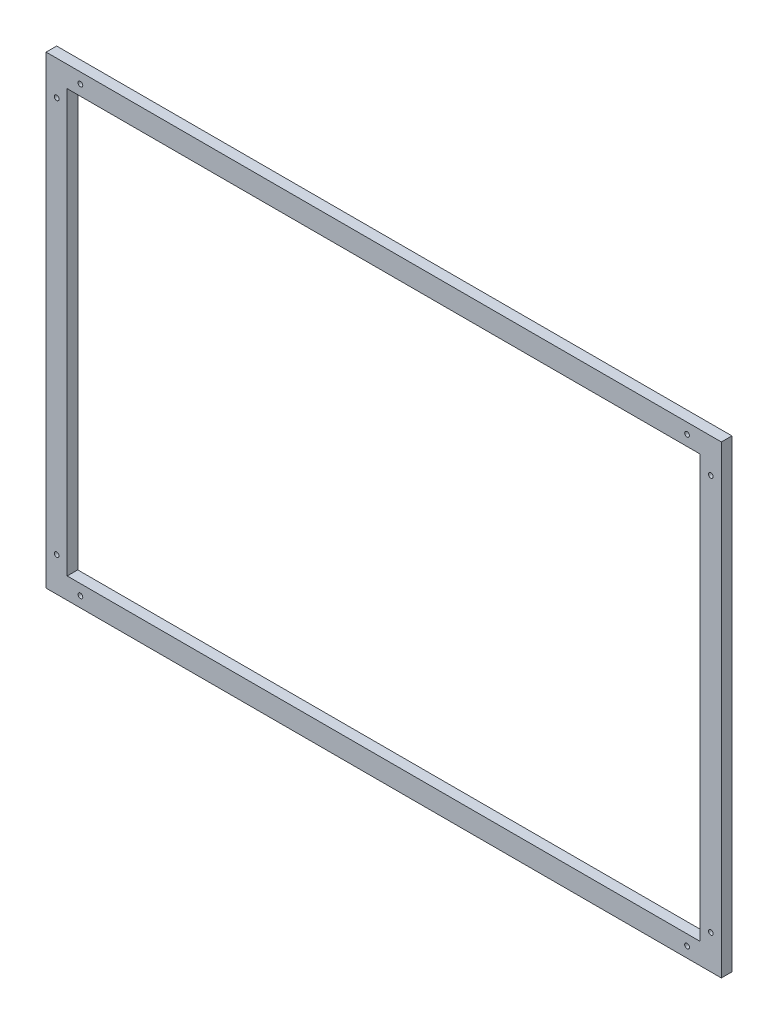
ISO-10303-21;
HEADER;
FILE_DESCRIPTION(('STEP AP214'),'2;1');
FILE_NAME('part.step','',(''),(''),'','','');
FILE_SCHEMA(('AUTOMOTIVE_DESIGN { 1 0 10303 214 1 1 1 1 }'));
ENDSEC;
DATA;
#1=APPLICATION_CONTEXT('core data for automotive mechanical design processes');
#2=APPLICATION_PROTOCOL_DEFINITION('international standard','automotive_design',2000,#1);
#3=PRODUCT_CONTEXT('',#1,'mechanical');
#4=PRODUCT('Part','Part','',(#3));
#5=PRODUCT_RELATED_PRODUCT_CATEGORY('part','',(#4));
#6=PRODUCT_DEFINITION_FORMATION('','',#4);
#7=PRODUCT_DEFINITION_CONTEXT('part definition',#1,'design');
#8=PRODUCT_DEFINITION('design','',#6,#7);
#9=PRODUCT_DEFINITION_SHAPE('','',#8);
#10=(LENGTH_UNIT() NAMED_UNIT(*) SI_UNIT(.MILLI.,.METRE.));
#11=(NAMED_UNIT(*) PLANE_ANGLE_UNIT() SI_UNIT($,.RADIAN.));
#12=(NAMED_UNIT(*) SI_UNIT($,.STERADIAN.) SOLID_ANGLE_UNIT());
#13=UNCERTAINTY_MEASURE_WITH_UNIT(LENGTH_MEASURE(1.E-05),#10,'distance_accuracy_value','');
#14=(GEOMETRIC_REPRESENTATION_CONTEXT(3) GLOBAL_UNCERTAINTY_ASSIGNED_CONTEXT((#13)) GLOBAL_UNIT_ASSIGNED_CONTEXT((#10,
#11,#12)) REPRESENTATION_CONTEXT('',''));
#15=CARTESIAN_POINT('',(0.,0.,0.));
#16=DIRECTION('',(0.,0.,1.));
#17=DIRECTION('',(1.,0.,0.));
#18=AXIS2_PLACEMENT_3D('',#15,#16,#17);
#19=CARTESIAN_POINT('',(0.,0.,10.));
#20=DIRECTION('',(0.,0.,1.));
#21=DIRECTION('',(1.,0.,0.));
#22=AXIS2_PLACEMENT_3D('',#19,#20,#21);
#23=PLANE('',#22);
#24=CARTESIAN_POINT('',(-10.,32.5,10.));
#25=DIRECTION('',(0.,0.,1.));
#26=DIRECTION('',(1.,0.,0.));
#27=AXIS2_PLACEMENT_3D('',#24,#25,#26);
#28=CIRCLE('',#27,2.25);
#29=CARTESIAN_POINT('',(-7.75,32.5,10.));
#30=VERTEX_POINT('',#29);
#31=EDGE_CURVE('E253',#30,#30,#28,.T.);
#32=ORIENTED_EDGE('',*,*,#31,.F.);
#33=EDGE_LOOP('',(#32));
#34=FACE_BOUND('',#33,.T.);
#35=CARTESIAN_POINT('',(-32.5,9.99999999999992,10.));
#36=DIRECTION('',(0.,0.,1.));
#37=DIRECTION('',(1.,0.,0.));
#38=AXIS2_PLACEMENT_3D('',#35,#36,#37);
#39=CIRCLE('',#38,2.25);
#40=CARTESIAN_POINT('',(-30.25,9.99999999999992,10.));
#41=VERTEX_POINT('',#40);
#42=EDGE_CURVE('E255',#41,#41,#39,.T.);
#43=ORIENTED_EDGE('',*,*,#42,.F.);
#44=EDGE_LOOP('',(#43));
#45=FACE_BOUND('',#44,.T.);
#46=CARTESIAN_POINT('',(-607.5,9.99999999999995,10.));
#47=DIRECTION('',(0.,0.,1.));
#48=DIRECTION('',(1.,0.,0.));
#49=AXIS2_PLACEMENT_3D('',#46,#47,#48);
#50=CIRCLE('',#49,2.25000000000001);
#51=CARTESIAN_POINT('',(-605.25,9.99999999999995,10.));
#52=VERTEX_POINT('',#51);
#53=EDGE_CURVE('E261',#52,#52,#50,.T.);
#54=ORIENTED_EDGE('',*,*,#53,.F.);
#55=EDGE_LOOP('',(#54));
#56=FACE_BOUND('',#55,.T.);
#57=CARTESIAN_POINT('',(-630.,32.4999999999999,10.));
#58=DIRECTION('',(0.,0.,1.));
#59=DIRECTION('',(1.,0.,0.));
#60=AXIS2_PLACEMENT_3D('',#57,#58,#59);
#61=CIRCLE('',#60,2.25000000000001);
#62=CARTESIAN_POINT('',(-627.75,32.4999999999999,10.));
#63=VERTEX_POINT('',#62);
#64=EDGE_CURVE('E267',#63,#63,#61,.T.);
#65=ORIENTED_EDGE('',*,*,#64,.F.);
#66=EDGE_LOOP('',(#65));
#67=FACE_BOUND('',#66,.T.);
#68=CARTESIAN_POINT('',(-630.,407.5,10.));
#69=DIRECTION('',(0.,0.,1.));
#70=DIRECTION('',(1.,0.,0.));
#71=AXIS2_PLACEMENT_3D('',#68,#69,#70);
#72=CIRCLE('',#71,2.25000000000001);
#73=CARTESIAN_POINT('',(-627.75,407.5,10.));
#74=VERTEX_POINT('',#73);
#75=EDGE_CURVE('E273',#74,#74,#72,.T.);
#76=ORIENTED_EDGE('',*,*,#75,.F.);
#77=EDGE_LOOP('',(#76));
#78=FACE_BOUND('',#77,.T.);
#79=CARTESIAN_POINT('',(-607.5,430.,10.));
#80=DIRECTION('',(0.,0.,1.));
#81=DIRECTION('',(1.,0.,0.));
#82=AXIS2_PLACEMENT_3D('',#79,#80,#81);
#83=CIRCLE('',#82,2.25000000000001);
#84=CARTESIAN_POINT('',(-605.25,430.,10.));
#85=VERTEX_POINT('',#84);
#86=EDGE_CURVE('E279',#85,#85,#83,.T.);
#87=ORIENTED_EDGE('',*,*,#86,.F.);
#88=EDGE_LOOP('',(#87));
#89=FACE_BOUND('',#88,.T.);
#90=CARTESIAN_POINT('',(-10.,407.5,10.));
#91=DIRECTION('',(0.,0.,1.));
#92=DIRECTION('',(1.,0.,0.));
#93=AXIS2_PLACEMENT_3D('',#90,#91,#92);
#94=CIRCLE('',#93,2.25);
#95=CARTESIAN_POINT('',(-7.75,407.5,10.));
#96=VERTEX_POINT('',#95);
#97=EDGE_CURVE('E285',#96,#96,#94,.T.);
#98=ORIENTED_EDGE('',*,*,#97,.F.);
#99=EDGE_LOOP('',(#98));
#100=FACE_BOUND('',#99,.T.);
#101=CARTESIAN_POINT('',(-32.5,430.,10.));
#102=DIRECTION('',(0.,0.,1.));
#103=DIRECTION('',(1.,0.,0.));
#104=AXIS2_PLACEMENT_3D('',#101,#102,#103);
#105=CIRCLE('',#104,2.25);
#106=CARTESIAN_POINT('',(-30.25,430.,10.));
#107=VERTEX_POINT('',#106);
#108=EDGE_CURVE('E291',#107,#107,#105,.T.);
#109=ORIENTED_EDGE('',*,*,#108,.F.);
#110=EDGE_LOOP('',(#109));
#111=FACE_BOUND('',#110,.T.);
#112=DIRECTION('',(0.,1.,0.));
#113=VECTOR('',#112,1.);
#114=CARTESIAN_POINT('',(0.,0.,10.));
#115=LINE('',#114,#113);
#116=CARTESIAN_POINT('',(0.,0.,10.));
#117=VERTEX_POINT('',#116);
#118=CARTESIAN_POINT('',(0.,440.,10.));
#119=VERTEX_POINT('',#118);
#120=EDGE_CURVE('E135',#117,#119,#115,.T.);
#121=ORIENTED_EDGE('',*,*,#120,.T.);
#122=DIRECTION('',(-1.,0.,0.));
#123=VECTOR('',#122,1.);
#124=CARTESIAN_POINT('',(0.,440.,10.));
#125=LINE('',#124,#123);
#126=CARTESIAN_POINT('',(-640.,440.,10.));
#127=VERTEX_POINT('',#126);
#128=EDGE_CURVE('E138',#119,#127,#125,.T.);
#129=ORIENTED_EDGE('',*,*,#128,.T.);
#130=DIRECTION('',(0.,-1.,0.));
#131=VECTOR('',#130,1.);
#132=CARTESIAN_POINT('',(-640.,0.,10.));
#133=LINE('',#132,#131);
#134=CARTESIAN_POINT('',(-640.,0.,10.));
#135=VERTEX_POINT('',#134);
#136=EDGE_CURVE('E141',#127,#135,#133,.T.);
#137=ORIENTED_EDGE('',*,*,#136,.T.);
#138=DIRECTION('',(1.,0.,0.));
#139=VECTOR('',#138,1.);
#140=CARTESIAN_POINT('',(0.,0.,10.));
#141=LINE('',#140,#139);
#142=EDGE_CURVE('E143',#135,#117,#141,.T.);
#143=ORIENTED_EDGE('',*,*,#142,.T.);
#144=EDGE_LOOP('',(#121,#129,#137,#143));
#145=FACE_BOUND('',#144,.T.);
#146=DIRECTION('',(1.,0.,0.));
#147=VECTOR('',#146,1.);
#148=CARTESIAN_POINT('',(-620.,19.9999999999999,10.));
#149=LINE('',#148,#147);
#150=CARTESIAN_POINT('',(-620.,19.9999999999999,10.));
#151=VERTEX_POINT('',#150);
#152=CARTESIAN_POINT('',(-20.,19.9999999999999,10.));
#153=VERTEX_POINT('',#152);
#154=EDGE_CURVE('E105',#151,#153,#149,.T.);
#155=ORIENTED_EDGE('',*,*,#154,.F.);
#156=DIRECTION('',(0.,-1.,0.));
#157=VECTOR('',#156,1.);
#158=CARTESIAN_POINT('',(-620.,420.,10.));
#159=LINE('',#158,#157);
#160=CARTESIAN_POINT('',(-620.,420.,10.));
#161=VERTEX_POINT('',#160);
#162=EDGE_CURVE('E97',#161,#151,#159,.T.);
#163=ORIENTED_EDGE('',*,*,#162,.F.);
#164=DIRECTION('',(-1.,0.,0.));
#165=VECTOR('',#164,1.);
#166=CARTESIAN_POINT('',(-620.,420.,10.));
#167=LINE('',#166,#165);
#168=CARTESIAN_POINT('',(-20.,420.,10.));
#169=VERTEX_POINT('',#168);
#170=EDGE_CURVE('E119',#169,#161,#167,.T.);
#171=ORIENTED_EDGE('',*,*,#170,.F.);
#172=DIRECTION('',(0.,1.,0.));
#173=VECTOR('',#172,1.);
#174=CARTESIAN_POINT('',(-20.,420.,10.));
#175=LINE('',#174,#173);
#176=EDGE_CURVE('E117',#153,#169,#175,.T.);
#177=ORIENTED_EDGE('',*,*,#176,.F.);
#178=EDGE_LOOP('',(#155,#163,#171,#177));
#179=FACE_BOUND('',#178,.T.);
#180=ADVANCED_FACE('F32',(#34,#45,#56,#67,#78,#89,#100,#111,#145,#179),#23,.T.);
#181=CARTESIAN_POINT('',(0.,0.,0.));
#182=DIRECTION('',(0.,0.,1.));
#183=DIRECTION('',(1.,0.,0.));
#184=AXIS2_PLACEMENT_3D('',#181,#182,#183);
#185=PLANE('',#184);
#186=CARTESIAN_POINT('',(-10.,32.5,0.));
#187=DIRECTION('',(0.,0.,1.));
#188=DIRECTION('',(1.,0.,0.));
#189=AXIS2_PLACEMENT_3D('',#186,#187,#188);
#190=CIRCLE('',#189,2.25);
#191=CARTESIAN_POINT('',(-7.75,32.5,0.));
#192=VERTEX_POINT('',#191);
#193=EDGE_CURVE('E251',#192,#192,#190,.T.);
#194=ORIENTED_EDGE('',*,*,#193,.T.);
#195=EDGE_LOOP('',(#194));
#196=FACE_BOUND('',#195,.T.);
#197=CARTESIAN_POINT('',(-32.5,9.99999999999992,0.));
#198=DIRECTION('',(0.,0.,1.));
#199=DIRECTION('',(1.,0.,0.));
#200=AXIS2_PLACEMENT_3D('',#197,#198,#199);
#201=CIRCLE('',#200,2.25);
#202=CARTESIAN_POINT('',(-30.25,9.99999999999992,0.));
#203=VERTEX_POINT('',#202);
#204=EDGE_CURVE('E258',#203,#203,#201,.T.);
#205=ORIENTED_EDGE('',*,*,#204,.T.);
#206=EDGE_LOOP('',(#205));
#207=FACE_BOUND('',#206,.T.);
#208=CARTESIAN_POINT('',(-607.5,9.99999999999995,0.));
#209=DIRECTION('',(0.,0.,1.));
#210=DIRECTION('',(1.,0.,0.));
#211=AXIS2_PLACEMENT_3D('',#208,#209,#210);
#212=CIRCLE('',#211,2.25000000000001);
#213=CARTESIAN_POINT('',(-605.25,9.99999999999995,0.));
#214=VERTEX_POINT('',#213);
#215=EDGE_CURVE('E264',#214,#214,#212,.T.);
#216=ORIENTED_EDGE('',*,*,#215,.T.);
#217=EDGE_LOOP('',(#216));
#218=FACE_BOUND('',#217,.T.);
#219=CARTESIAN_POINT('',(-630.,32.4999999999999,0.));
#220=DIRECTION('',(0.,0.,1.));
#221=DIRECTION('',(1.,0.,0.));
#222=AXIS2_PLACEMENT_3D('',#219,#220,#221);
#223=CIRCLE('',#222,2.25000000000001);
#224=CARTESIAN_POINT('',(-627.75,32.4999999999999,0.));
#225=VERTEX_POINT('',#224);
#226=EDGE_CURVE('E270',#225,#225,#223,.T.);
#227=ORIENTED_EDGE('',*,*,#226,.T.);
#228=EDGE_LOOP('',(#227));
#229=FACE_BOUND('',#228,.T.);
#230=CARTESIAN_POINT('',(-630.,407.5,0.));
#231=DIRECTION('',(0.,0.,1.));
#232=DIRECTION('',(1.,0.,0.));
#233=AXIS2_PLACEMENT_3D('',#230,#231,#232);
#234=CIRCLE('',#233,2.25000000000001);
#235=CARTESIAN_POINT('',(-627.75,407.5,0.));
#236=VERTEX_POINT('',#235);
#237=EDGE_CURVE('E276',#236,#236,#234,.T.);
#238=ORIENTED_EDGE('',*,*,#237,.T.);
#239=EDGE_LOOP('',(#238));
#240=FACE_BOUND('',#239,.T.);
#241=CARTESIAN_POINT('',(-607.5,430.,0.));
#242=DIRECTION('',(0.,0.,1.));
#243=DIRECTION('',(1.,0.,0.));
#244=AXIS2_PLACEMENT_3D('',#241,#242,#243);
#245=CIRCLE('',#244,2.25000000000001);
#246=CARTESIAN_POINT('',(-605.25,430.,0.));
#247=VERTEX_POINT('',#246);
#248=EDGE_CURVE('E282',#247,#247,#245,.T.);
#249=ORIENTED_EDGE('',*,*,#248,.T.);
#250=EDGE_LOOP('',(#249));
#251=FACE_BOUND('',#250,.T.);
#252=CARTESIAN_POINT('',(-10.,407.5,0.));
#253=DIRECTION('',(0.,0.,1.));
#254=DIRECTION('',(1.,0.,0.));
#255=AXIS2_PLACEMENT_3D('',#252,#253,#254);
#256=CIRCLE('',#255,2.25);
#257=CARTESIAN_POINT('',(-7.75,407.5,0.));
#258=VERTEX_POINT('',#257);
#259=EDGE_CURVE('E288',#258,#258,#256,.T.);
#260=ORIENTED_EDGE('',*,*,#259,.T.);
#261=EDGE_LOOP('',(#260));
#262=FACE_BOUND('',#261,.T.);
#263=CARTESIAN_POINT('',(-32.5,430.,0.));
#264=DIRECTION('',(0.,0.,1.));
#265=DIRECTION('',(1.,0.,0.));
#266=AXIS2_PLACEMENT_3D('',#263,#264,#265);
#267=CIRCLE('',#266,2.25);
#268=CARTESIAN_POINT('',(-30.25,430.,0.));
#269=VERTEX_POINT('',#268);
#270=EDGE_CURVE('E125',#269,#269,#267,.T.);
#271=ORIENTED_EDGE('',*,*,#270,.T.);
#272=EDGE_LOOP('',(#271));
#273=FACE_BOUND('',#272,.T.);
#274=DIRECTION('',(0.,1.,0.));
#275=VECTOR('',#274,1.);
#276=CARTESIAN_POINT('',(0.,0.,0.));
#277=LINE('',#276,#275);
#278=CARTESIAN_POINT('',(0.,0.,0.));
#279=VERTEX_POINT('',#278);
#280=CARTESIAN_POINT('',(0.,440.,0.));
#281=VERTEX_POINT('',#280);
#282=EDGE_CURVE('E113',#279,#281,#277,.T.);
#283=ORIENTED_EDGE('',*,*,#282,.F.);
#284=DIRECTION('',(1.,0.,0.));
#285=VECTOR('',#284,1.);
#286=CARTESIAN_POINT('',(0.,0.,0.));
#287=LINE('',#286,#285);
#288=CARTESIAN_POINT('',(-640.,0.,0.));
#289=VERTEX_POINT('',#288);
#290=EDGE_CURVE('E139',#289,#279,#287,.T.);
#291=ORIENTED_EDGE('',*,*,#290,.F.);
#292=DIRECTION('',(0.,-1.,0.));
#293=VECTOR('',#292,1.);
#294=CARTESIAN_POINT('',(-640.,0.,0.));
#295=LINE('',#294,#293);
#296=CARTESIAN_POINT('',(-640.,440.,0.));
#297=VERTEX_POINT('',#296);
#298=EDGE_CURVE('E150',#297,#289,#295,.T.);
#299=ORIENTED_EDGE('',*,*,#298,.F.);
#300=DIRECTION('',(-1.,0.,0.));
#301=VECTOR('',#300,1.);
#302=CARTESIAN_POINT('',(0.,440.,0.));
#303=LINE('',#302,#301);
#304=EDGE_CURVE('E148',#281,#297,#303,.T.);
#305=ORIENTED_EDGE('',*,*,#304,.F.);
#306=EDGE_LOOP('',(#283,#291,#299,#305));
#307=FACE_BOUND('',#306,.T.);
#308=DIRECTION('',(0.,-1.,0.));
#309=VECTOR('',#308,1.);
#310=CARTESIAN_POINT('',(-620.,420.,0.));
#311=LINE('',#310,#309);
#312=CARTESIAN_POINT('',(-620.,420.,0.));
#313=VERTEX_POINT('',#312);
#314=CARTESIAN_POINT('',(-620.,19.9999999999999,0.));
#315=VERTEX_POINT('',#314);
#316=EDGE_CURVE('E55',#313,#315,#311,.T.);
#317=ORIENTED_EDGE('',*,*,#316,.T.);
#318=DIRECTION('',(1.,0.,0.));
#319=VECTOR('',#318,1.);
#320=CARTESIAN_POINT('',(-620.,19.9999999999999,0.));
#321=LINE('',#320,#319);
#322=CARTESIAN_POINT('',(-20.,19.9999999999999,0.));
#323=VERTEX_POINT('',#322);
#324=EDGE_CURVE('E112',#315,#323,#321,.T.);
#325=ORIENTED_EDGE('',*,*,#324,.T.);
#326=DIRECTION('',(0.,1.,0.));
#327=VECTOR('',#326,1.);
#328=CARTESIAN_POINT('',(-20.,420.,0.));
#329=LINE('',#328,#327);
#330=CARTESIAN_POINT('',(-20.,420.,0.));
#331=VERTEX_POINT('',#330);
#332=EDGE_CURVE('E127',#323,#331,#329,.T.);
#333=ORIENTED_EDGE('',*,*,#332,.T.);
#334=DIRECTION('',(-1.,0.,0.));
#335=VECTOR('',#334,1.);
#336=CARTESIAN_POINT('',(-620.,420.,0.));
#337=LINE('',#336,#335);
#338=EDGE_CURVE('E106',#331,#313,#337,.T.);
#339=ORIENTED_EDGE('',*,*,#338,.T.);
#340=EDGE_LOOP('',(#317,#325,#333,#339));
#341=FACE_BOUND('',#340,.T.);
#342=ADVANCED_FACE('F168',(#196,#207,#218,#229,#240,#251,#262,#273,#307,#341),#185,.F.);
#343=CARTESIAN_POINT('',(0.,0.,10.));
#344=DIRECTION('',(-1.,0.,0.));
#345=DIRECTION('',(0.,0.,1.));
#346=AXIS2_PLACEMENT_3D('',#343,#344,#345);
#347=PLANE('',#346);
#348=ORIENTED_EDGE('',*,*,#282,.T.);
#349=DIRECTION('',(0.,0.,-1.));
#350=VECTOR('',#349,1.);
#351=CARTESIAN_POINT('',(0.,440.,10.));
#352=LINE('',#351,#350);
#353=EDGE_CURVE('E11',#119,#281,#352,.T.);
#354=ORIENTED_EDGE('',*,*,#353,.F.);
#355=ORIENTED_EDGE('',*,*,#120,.F.);
#356=DIRECTION('',(0.,0.,-1.));
#357=VECTOR('',#356,1.);
#358=CARTESIAN_POINT('',(0.,0.,10.));
#359=LINE('',#358,#357);
#360=EDGE_CURVE('E145',#117,#279,#359,.T.);
#361=ORIENTED_EDGE('',*,*,#360,.T.);
#362=EDGE_LOOP('',(#348,#354,#355,#361));
#363=FACE_BOUND('',#362,.T.);
#364=ADVANCED_FACE('F34',(#363),#347,.F.);
#365=CARTESIAN_POINT('',(0.,440.,10.));
#366=DIRECTION('',(0.,-1.,0.));
#367=DIRECTION('',(1.,0.,0.));
#368=AXIS2_PLACEMENT_3D('',#365,#366,#367);
#369=PLANE('',#368);
#370=ORIENTED_EDGE('',*,*,#304,.T.);
#371=DIRECTION('',(0.,0.,-1.));
#372=VECTOR('',#371,1.);
#373=CARTESIAN_POINT('',(-640.,440.,10.));
#374=LINE('',#373,#372);
#375=EDGE_CURVE('E40',#127,#297,#374,.T.);
#376=ORIENTED_EDGE('',*,*,#375,.F.);
#377=ORIENTED_EDGE('',*,*,#128,.F.);
#378=ORIENTED_EDGE('',*,*,#353,.T.);
#379=EDGE_LOOP('',(#370,#376,#377,#378));
#380=FACE_BOUND('',#379,.T.);
#381=ADVANCED_FACE('F178',(#380),#369,.F.);
#382=CARTESIAN_POINT('',(-640.,0.,10.));
#383=DIRECTION('',(1.,0.,0.));
#384=DIRECTION('',(0.,0.,-1.));
#385=AXIS2_PLACEMENT_3D('',#382,#383,#384);
#386=PLANE('',#385);
#387=ORIENTED_EDGE('',*,*,#298,.T.);
#388=DIRECTION('',(0.,0.,-1.));
#389=VECTOR('',#388,1.);
#390=CARTESIAN_POINT('',(-640.,0.,10.));
#391=LINE('',#390,#389);
#392=EDGE_CURVE('E155',#135,#289,#391,.T.);
#393=ORIENTED_EDGE('',*,*,#392,.F.);
#394=ORIENTED_EDGE('',*,*,#136,.F.);
#395=ORIENTED_EDGE('',*,*,#375,.T.);
#396=EDGE_LOOP('',(#387,#393,#394,#395));
#397=FACE_BOUND('',#396,.T.);
#398=ADVANCED_FACE('F162',(#397),#386,.F.);
#399=CARTESIAN_POINT('',(0.,0.,10.));
#400=DIRECTION('',(0.,1.,0.));
#401=DIRECTION('',(-1.,0.,0.));
#402=AXIS2_PLACEMENT_3D('',#399,#400,#401);
#403=PLANE('',#402);
#404=ORIENTED_EDGE('',*,*,#290,.T.);
#405=ORIENTED_EDGE('',*,*,#360,.F.);
#406=ORIENTED_EDGE('',*,*,#142,.F.);
#407=ORIENTED_EDGE('',*,*,#392,.T.);
#408=EDGE_LOOP('',(#404,#405,#406,#407));
#409=FACE_BOUND('',#408,.T.);
#410=ADVANCED_FACE('F172',(#409),#403,.F.);
#411=CARTESIAN_POINT('',(-620.,420.,10.));
#412=DIRECTION('',(1.,0.,0.));
#413=DIRECTION('',(0.,1.,0.));
#414=AXIS2_PLACEMENT_3D('',#411,#412,#413);
#415=PLANE('',#414);
#416=ORIENTED_EDGE('',*,*,#316,.F.);
#417=DIRECTION('',(0.,0.,-1.));
#418=VECTOR('',#417,1.);
#419=CARTESIAN_POINT('',(-620.,420.,10.));
#420=LINE('',#419,#418);
#421=EDGE_CURVE('E101',#161,#313,#420,.T.);
#422=ORIENTED_EDGE('',*,*,#421,.F.);
#423=ORIENTED_EDGE('',*,*,#162,.T.);
#424=DIRECTION('',(0.,0.,-1.));
#425=VECTOR('',#424,1.);
#426=CARTESIAN_POINT('',(-620.,19.9999999999999,10.));
#427=LINE('',#426,#425);
#428=EDGE_CURVE('E100',#151,#315,#427,.T.);
#429=ORIENTED_EDGE('',*,*,#428,.T.);
#430=EDGE_LOOP('',(#416,#422,#423,#429));
#431=FACE_BOUND('',#430,.T.);
#432=ADVANCED_FACE('F99',(#431),#415,.T.);
#433=CARTESIAN_POINT('',(-620.,19.9999999999999,10.));
#434=DIRECTION('',(0.,1.,0.));
#435=DIRECTION('',(-1.,0.,0.));
#436=AXIS2_PLACEMENT_3D('',#433,#434,#435);
#437=PLANE('',#436);
#438=ORIENTED_EDGE('',*,*,#324,.F.);
#439=ORIENTED_EDGE('',*,*,#428,.F.);
#440=ORIENTED_EDGE('',*,*,#154,.T.);
#441=DIRECTION('',(0.,0.,-1.));
#442=VECTOR('',#441,1.);
#443=CARTESIAN_POINT('',(-20.,19.9999999999999,10.));
#444=LINE('',#443,#442);
#445=EDGE_CURVE('E114',#153,#323,#444,.T.);
#446=ORIENTED_EDGE('',*,*,#445,.T.);
#447=EDGE_LOOP('',(#438,#439,#440,#446));
#448=FACE_BOUND('',#447,.T.);
#449=ADVANCED_FACE('F109',(#448),#437,.T.);
#450=CARTESIAN_POINT('',(-20.,420.,10.));
#451=DIRECTION('',(-1.,0.,0.));
#452=DIRECTION('',(0.,0.,1.));
#453=AXIS2_PLACEMENT_3D('',#450,#451,#452);
#454=PLANE('',#453);
#455=ORIENTED_EDGE('',*,*,#332,.F.);
#456=ORIENTED_EDGE('',*,*,#445,.F.);
#457=ORIENTED_EDGE('',*,*,#176,.T.);
#458=DIRECTION('',(0.,0.,-1.));
#459=VECTOR('',#458,1.);
#460=CARTESIAN_POINT('',(-20.,420.,10.));
#461=LINE('',#460,#459);
#462=EDGE_CURVE('E47',#169,#331,#461,.T.);
#463=ORIENTED_EDGE('',*,*,#462,.T.);
#464=EDGE_LOOP('',(#455,#456,#457,#463));
#465=FACE_BOUND('',#464,.T.);
#466=ADVANCED_FACE('F205',(#465),#454,.T.);
#467=CARTESIAN_POINT('',(-620.,420.,10.));
#468=DIRECTION('',(0.,-1.,0.));
#469=DIRECTION('',(0.,0.,-1.));
#470=AXIS2_PLACEMENT_3D('',#467,#468,#469);
#471=PLANE('',#470);
#472=ORIENTED_EDGE('',*,*,#338,.F.);
#473=ORIENTED_EDGE('',*,*,#462,.F.);
#474=ORIENTED_EDGE('',*,*,#170,.T.);
#475=ORIENTED_EDGE('',*,*,#421,.T.);
#476=EDGE_LOOP('',(#472,#473,#474,#475));
#477=FACE_BOUND('',#476,.T.);
#478=ADVANCED_FACE('F209',(#477),#471,.T.);
#479=CARTESIAN_POINT('',(-32.5,430.,0.));
#480=DIRECTION('',(0.,0.,1.));
#481=DIRECTION('',(1.,0.,0.));
#482=AXIS2_PLACEMENT_3D('',#479,#480,#481);
#483=CYLINDRICAL_SURFACE('',#482,2.25);
#484=ORIENTED_EDGE('',*,*,#270,.F.);
#485=EDGE_LOOP('',(#484));
#486=FACE_BOUND('',#485,.T.);
#487=ORIENTED_EDGE('',*,*,#108,.T.);
#488=EDGE_LOOP('',(#487));
#489=FACE_BOUND('',#488,.T.);
#490=ADVANCED_FACE('F215',(#486,#489),#483,.F.);
#491=CARTESIAN_POINT('',(-10.,407.5,0.));
#492=DIRECTION('',(0.,0.,1.));
#493=DIRECTION('',(1.,0.,0.));
#494=AXIS2_PLACEMENT_3D('',#491,#492,#493);
#495=CYLINDRICAL_SURFACE('',#494,2.25);
#496=ORIENTED_EDGE('',*,*,#259,.F.);
#497=EDGE_LOOP('',(#496));
#498=FACE_BOUND('',#497,.T.);
#499=ORIENTED_EDGE('',*,*,#97,.T.);
#500=EDGE_LOOP('',(#499));
#501=FACE_BOUND('',#500,.T.);
#502=ADVANCED_FACE('F218',(#498,#501),#495,.F.);
#503=CARTESIAN_POINT('',(-607.5,430.,0.));
#504=DIRECTION('',(0.,0.,1.));
#505=DIRECTION('',(1.,0.,0.));
#506=AXIS2_PLACEMENT_3D('',#503,#504,#505);
#507=CYLINDRICAL_SURFACE('',#506,2.25000000000001);
#508=ORIENTED_EDGE('',*,*,#248,.F.);
#509=EDGE_LOOP('',(#508));
#510=FACE_BOUND('',#509,.T.);
#511=ORIENTED_EDGE('',*,*,#86,.T.);
#512=EDGE_LOOP('',(#511));
#513=FACE_BOUND('',#512,.T.);
#514=ADVANCED_FACE('F222',(#510,#513),#507,.F.);
#515=CARTESIAN_POINT('',(-630.,407.5,0.));
#516=DIRECTION('',(0.,0.,1.));
#517=DIRECTION('',(1.,0.,0.));
#518=AXIS2_PLACEMENT_3D('',#515,#516,#517);
#519=CYLINDRICAL_SURFACE('',#518,2.25000000000001);
#520=ORIENTED_EDGE('',*,*,#237,.F.);
#521=EDGE_LOOP('',(#520));
#522=FACE_BOUND('',#521,.T.);
#523=ORIENTED_EDGE('',*,*,#75,.T.);
#524=EDGE_LOOP('',(#523));
#525=FACE_BOUND('',#524,.T.);
#526=ADVANCED_FACE('F226',(#522,#525),#519,.F.);
#527=CARTESIAN_POINT('',(-630.,32.4999999999999,0.));
#528=DIRECTION('',(0.,0.,1.));
#529=DIRECTION('',(1.,0.,0.));
#530=AXIS2_PLACEMENT_3D('',#527,#528,#529);
#531=CYLINDRICAL_SURFACE('',#530,2.25000000000001);
#532=ORIENTED_EDGE('',*,*,#226,.F.);
#533=EDGE_LOOP('',(#532));
#534=FACE_BOUND('',#533,.T.);
#535=ORIENTED_EDGE('',*,*,#64,.T.);
#536=EDGE_LOOP('',(#535));
#537=FACE_BOUND('',#536,.T.);
#538=ADVANCED_FACE('F230',(#534,#537),#531,.F.);
#539=CARTESIAN_POINT('',(-607.5,9.99999999999995,0.));
#540=DIRECTION('',(0.,0.,1.));
#541=DIRECTION('',(1.,0.,0.));
#542=AXIS2_PLACEMENT_3D('',#539,#540,#541);
#543=CYLINDRICAL_SURFACE('',#542,2.25000000000001);
#544=ORIENTED_EDGE('',*,*,#215,.F.);
#545=EDGE_LOOP('',(#544));
#546=FACE_BOUND('',#545,.T.);
#547=ORIENTED_EDGE('',*,*,#53,.T.);
#548=EDGE_LOOP('',(#547));
#549=FACE_BOUND('',#548,.T.);
#550=ADVANCED_FACE('F234',(#546,#549),#543,.F.);
#551=CARTESIAN_POINT('',(-32.5,9.99999999999992,0.));
#552=DIRECTION('',(0.,0.,1.));
#553=DIRECTION('',(1.,0.,0.));
#554=AXIS2_PLACEMENT_3D('',#551,#552,#553);
#555=CYLINDRICAL_SURFACE('',#554,2.25);
#556=ORIENTED_EDGE('',*,*,#204,.F.);
#557=EDGE_LOOP('',(#556));
#558=FACE_BOUND('',#557,.T.);
#559=ORIENTED_EDGE('',*,*,#42,.T.);
#560=EDGE_LOOP('',(#559));
#561=FACE_BOUND('',#560,.T.);
#562=ADVANCED_FACE('F238',(#558,#561),#555,.F.);
#563=CARTESIAN_POINT('',(-10.,32.5,0.));
#564=DIRECTION('',(0.,0.,1.));
#565=DIRECTION('',(1.,0.,0.));
#566=AXIS2_PLACEMENT_3D('',#563,#564,#565);
#567=CYLINDRICAL_SURFACE('',#566,2.25);
#568=ORIENTED_EDGE('',*,*,#193,.F.);
#569=EDGE_LOOP('',(#568));
#570=FACE_BOUND('',#569,.T.);
#571=ORIENTED_EDGE('',*,*,#31,.T.);
#572=EDGE_LOOP('',(#571));
#573=FACE_BOUND('',#572,.T.);
#574=ADVANCED_FACE('F242',(#570,#573),#567,.F.);
#575=CLOSED_SHELL('',(#180,#342,#364,#381,#398,#410,#432,#449,#466,#478,#490,#502,#514,#526,
#538,#550,#562,#574));
#576=MANIFOLD_SOLID_BREP('B2',#575);
#577=ADVANCED_BREP_SHAPE_REPRESENTATION('',(#18,#576),#14);
#578=SHAPE_DEFINITION_REPRESENTATION(#9,#577);
ENDSEC;
END-ISO-10303-21;
